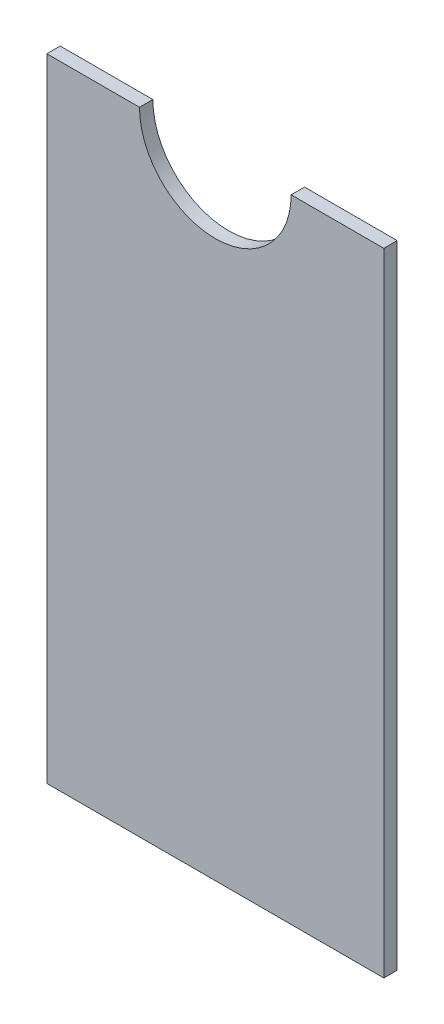
ISO-10303-21;
HEADER;
FILE_DESCRIPTION(('STEP AP214'),'2;1');
FILE_NAME('part.step','',(''),(''),'','','');
FILE_SCHEMA(('AUTOMOTIVE_DESIGN { 1 0 10303 214 1 1 1 1 }'));
ENDSEC;
DATA;
#1=APPLICATION_CONTEXT('core data for automotive mechanical design processes');
#2=APPLICATION_PROTOCOL_DEFINITION('international standard','automotive_design',2000,#1);
#3=PRODUCT_CONTEXT('',#1,'mechanical');
#4=PRODUCT('Part','Part','',(#3));
#5=PRODUCT_RELATED_PRODUCT_CATEGORY('part','',(#4));
#6=PRODUCT_DEFINITION_FORMATION('','',#4);
#7=PRODUCT_DEFINITION_CONTEXT('part definition',#1,'design');
#8=PRODUCT_DEFINITION('design','',#6,#7);
#9=PRODUCT_DEFINITION_SHAPE('','',#8);
#10=(LENGTH_UNIT() NAMED_UNIT(*) SI_UNIT(.MILLI.,.METRE.));
#11=(NAMED_UNIT(*) PLANE_ANGLE_UNIT() SI_UNIT($,.RADIAN.));
#12=(NAMED_UNIT(*) SI_UNIT($,.STERADIAN.) SOLID_ANGLE_UNIT());
#13=UNCERTAINTY_MEASURE_WITH_UNIT(LENGTH_MEASURE(1.E-05),#10,'distance_accuracy_value','');
#14=(GEOMETRIC_REPRESENTATION_CONTEXT(3) GLOBAL_UNCERTAINTY_ASSIGNED_CONTEXT((#13)) GLOBAL_UNIT_ASSIGNED_CONTEXT((#10,
#11,#12)) REPRESENTATION_CONTEXT('',''));
#15=CARTESIAN_POINT('',(0.,0.,0.));
#16=DIRECTION('',(0.,0.,1.));
#17=DIRECTION('',(1.,0.,0.));
#18=AXIS2_PLACEMENT_3D('',#15,#16,#17);
#19=CARTESIAN_POINT('',(-40.,75.,3.175));
#20=DIRECTION('',(0.,1.,0.));
#21=DIRECTION('',(0.,0.,1.));
#22=AXIS2_PLACEMENT_3D('',#19,#20,#21);
#23=PLANE('',#22);
#24=DIRECTION('',(1.,0.,0.));
#25=VECTOR('',#24,1.);
#26=CARTESIAN_POINT('',(-40.,75.,0.));
#27=LINE('',#26,#25);
#28=CARTESIAN_POINT('',(-40.,75.,0.));
#29=VERTEX_POINT('',#28);
#30=CARTESIAN_POINT('',(-18.,75.,0.));
#31=VERTEX_POINT('',#30);
#32=EDGE_CURVE('E124',#29,#31,#27,.T.);
#33=ORIENTED_EDGE('',*,*,#32,.F.);
#34=DIRECTION('',(0.,0.,-1.));
#35=VECTOR('',#34,1.);
#36=CARTESIAN_POINT('',(-40.,75.,3.175));
#37=LINE('',#36,#35);
#38=CARTESIAN_POINT('',(-40.,75.,3.175));
#39=VERTEX_POINT('',#38);
#40=EDGE_CURVE('E11',#39,#29,#37,.T.);
#41=ORIENTED_EDGE('',*,*,#40,.F.);
#42=DIRECTION('',(1.,0.,0.));
#43=VECTOR('',#42,1.);
#44=CARTESIAN_POINT('',(-40.,75.,3.175));
#45=LINE('',#44,#43);
#46=CARTESIAN_POINT('',(-18.,75.,3.175));
#47=VERTEX_POINT('',#46);
#48=EDGE_CURVE('E136',#39,#47,#45,.T.);
#49=ORIENTED_EDGE('',*,*,#48,.T.);
#50=DIRECTION('',(0.,0.,-1.));
#51=VECTOR('',#50,1.);
#52=CARTESIAN_POINT('',(-18.,75.,3.175));
#53=LINE('',#52,#51);
#54=EDGE_CURVE('E40',#47,#31,#53,.T.);
#55=ORIENTED_EDGE('',*,*,#54,.T.);
#56=EDGE_LOOP('',(#33,#41,#49,#55));
#57=FACE_BOUND('',#56,.T.);
#58=ADVANCED_FACE('F37',(#57),#23,.T.);
#59=CARTESIAN_POINT('',(-40.,75.,3.175));
#60=DIRECTION('',(1.,0.,0.));
#61=DIRECTION('',(0.,1.,0.));
#62=AXIS2_PLACEMENT_3D('',#59,#60,#61);
#63=PLANE('',#62);
#64=DIRECTION('',(0.,-1.,0.));
#65=VECTOR('',#64,1.);
#66=CARTESIAN_POINT('',(-40.,75.,0.));
#67=LINE('',#66,#65);
#68=CARTESIAN_POINT('',(-40.,-75.,0.));
#69=VERTEX_POINT('',#68);
#70=EDGE_CURVE('E76',#29,#69,#67,.T.);
#71=ORIENTED_EDGE('',*,*,#70,.T.);
#72=DIRECTION('',(0.,0.,-1.));
#73=VECTOR('',#72,1.);
#74=CARTESIAN_POINT('',(-40.,-75.,3.175));
#75=LINE('',#74,#73);
#76=CARTESIAN_POINT('',(-40.,-75.,3.175));
#77=VERTEX_POINT('',#76);
#78=EDGE_CURVE('E46',#77,#69,#75,.T.);
#79=ORIENTED_EDGE('',*,*,#78,.F.);
#80=DIRECTION('',(0.,-1.,0.));
#81=VECTOR('',#80,1.);
#82=CARTESIAN_POINT('',(-40.,75.,3.175));
#83=LINE('',#82,#81);
#84=EDGE_CURVE('E103',#39,#77,#83,.T.);
#85=ORIENTED_EDGE('',*,*,#84,.F.);
#86=ORIENTED_EDGE('',*,*,#40,.T.);
#87=EDGE_LOOP('',(#71,#79,#85,#86));
#88=FACE_BOUND('',#87,.T.);
#89=ADVANCED_FACE('F155',(#88),#63,.F.);
#90=CARTESIAN_POINT('',(-40.,-75.,3.175));
#91=DIRECTION('',(0.,1.,0.));
#92=DIRECTION('',(0.,0.,1.));
#93=AXIS2_PLACEMENT_3D('',#90,#91,#92);
#94=PLANE('',#93);
#95=DIRECTION('',(1.,0.,0.));
#96=VECTOR('',#95,1.);
#97=CARTESIAN_POINT('',(-40.,-75.,0.));
#98=LINE('',#97,#96);
#99=CARTESIAN_POINT('',(40.,-75.,0.));
#100=VERTEX_POINT('',#99);
#101=EDGE_CURVE('E110',#69,#100,#98,.T.);
#102=ORIENTED_EDGE('',*,*,#101,.T.);
#103=DIRECTION('',(0.,0.,-1.));
#104=VECTOR('',#103,1.);
#105=CARTESIAN_POINT('',(40.,-75.,3.175));
#106=LINE('',#105,#104);
#107=CARTESIAN_POINT('',(40.,-75.,3.175));
#108=VERTEX_POINT('',#107);
#109=EDGE_CURVE('E107',#108,#100,#106,.T.);
#110=ORIENTED_EDGE('',*,*,#109,.F.);
#111=DIRECTION('',(1.,0.,0.));
#112=VECTOR('',#111,1.);
#113=CARTESIAN_POINT('',(-40.,-75.,3.175));
#114=LINE('',#113,#112);
#115=EDGE_CURVE('E95',#77,#108,#114,.T.);
#116=ORIENTED_EDGE('',*,*,#115,.F.);
#117=ORIENTED_EDGE('',*,*,#78,.T.);
#118=EDGE_LOOP('',(#102,#110,#116,#117));
#119=FACE_BOUND('',#118,.T.);
#120=ADVANCED_FACE('F108',(#119),#94,.F.);
#121=CARTESIAN_POINT('',(40.,75.,3.175));
#122=DIRECTION('',(1.,0.,0.));
#123=DIRECTION('',(0.,1.,0.));
#124=AXIS2_PLACEMENT_3D('',#121,#122,#123);
#125=PLANE('',#124);
#126=DIRECTION('',(0.,-1.,0.));
#127=VECTOR('',#126,1.);
#128=CARTESIAN_POINT('',(40.,75.,0.));
#129=LINE('',#128,#127);
#130=CARTESIAN_POINT('',(40.,75.,0.));
#131=VERTEX_POINT('',#130);
#132=EDGE_CURVE('E133',#131,#100,#129,.T.);
#133=ORIENTED_EDGE('',*,*,#132,.F.);
#134=DIRECTION('',(0.,0.,-1.));
#135=VECTOR('',#134,1.);
#136=CARTESIAN_POINT('',(40.,75.,3.175));
#137=LINE('',#136,#135);
#138=CARTESIAN_POINT('',(40.,75.,3.175));
#139=VERTEX_POINT('',#138);
#140=EDGE_CURVE('E114',#139,#131,#137,.T.);
#141=ORIENTED_EDGE('',*,*,#140,.F.);
#142=DIRECTION('',(0.,-1.,0.));
#143=VECTOR('',#142,1.);
#144=CARTESIAN_POINT('',(40.,75.,3.175));
#145=LINE('',#144,#143);
#146=EDGE_CURVE('E101',#139,#108,#145,.T.);
#147=ORIENTED_EDGE('',*,*,#146,.T.);
#148=ORIENTED_EDGE('',*,*,#109,.T.);
#149=EDGE_LOOP('',(#133,#141,#147,#148));
#150=FACE_BOUND('',#149,.T.);
#151=ADVANCED_FACE('F116',(#150),#125,.T.);
#152=CARTESIAN_POINT('',(18.,75.,3.175));
#153=DIRECTION('',(0.,1.,0.));
#154=DIRECTION('',(0.,0.,1.));
#155=AXIS2_PLACEMENT_3D('',#152,#153,#154);
#156=PLANE('',#155);
#157=DIRECTION('',(1.,0.,0.));
#158=VECTOR('',#157,1.);
#159=CARTESIAN_POINT('',(18.,75.,0.));
#160=LINE('',#159,#158);
#161=CARTESIAN_POINT('',(18.,75.,0.));
#162=VERTEX_POINT('',#161);
#163=EDGE_CURVE('E130',#162,#131,#160,.T.);
#164=ORIENTED_EDGE('',*,*,#163,.F.);
#165=DIRECTION('',(0.,0.,-1.));
#166=VECTOR('',#165,1.);
#167=CARTESIAN_POINT('',(18.,75.,3.175));
#168=LINE('',#167,#166);
#169=CARTESIAN_POINT('',(18.,75.,3.175));
#170=VERTEX_POINT('',#169);
#171=EDGE_CURVE('E139',#170,#162,#168,.T.);
#172=ORIENTED_EDGE('',*,*,#171,.F.);
#173=DIRECTION('',(1.,0.,0.));
#174=VECTOR('',#173,1.);
#175=CARTESIAN_POINT('',(18.,75.,3.175));
#176=LINE('',#175,#174);
#177=EDGE_CURVE('E117',#170,#139,#176,.T.);
#178=ORIENTED_EDGE('',*,*,#177,.T.);
#179=ORIENTED_EDGE('',*,*,#140,.T.);
#180=EDGE_LOOP('',(#164,#172,#178,#179));
#181=FACE_BOUND('',#180,.T.);
#182=ADVANCED_FACE('F145',(#181),#156,.T.);
#183=CARTESIAN_POINT('',(0.,75.,3.175));
#184=DIRECTION('',(0.,0.,-1.));
#185=DIRECTION('',(-1.,0.,0.));
#186=AXIS2_PLACEMENT_3D('',#183,#184,#185);
#187=CYLINDRICAL_SURFACE('',#186,18.);
#188=CARTESIAN_POINT('',(0.,75.,0.));
#189=DIRECTION('',(0.,0.,1.));
#190=DIRECTION('',(1.,0.,0.));
#191=AXIS2_PLACEMENT_3D('',#188,#189,#190);
#192=CIRCLE('',#191,18.);
#193=EDGE_CURVE('E127',#31,#162,#192,.T.);
#194=ORIENTED_EDGE('',*,*,#193,.F.);
#195=ORIENTED_EDGE('',*,*,#54,.F.);
#196=CARTESIAN_POINT('',(0.,75.,3.175));
#197=DIRECTION('',(0.,0.,1.));
#198=DIRECTION('',(1.,0.,0.));
#199=AXIS2_PLACEMENT_3D('',#196,#197,#198);
#200=CIRCLE('',#199,18.);
#201=EDGE_CURVE('E119',#47,#170,#200,.T.);
#202=ORIENTED_EDGE('',*,*,#201,.T.);
#203=ORIENTED_EDGE('',*,*,#171,.T.);
#204=EDGE_LOOP('',(#194,#195,#202,#203));
#205=FACE_BOUND('',#204,.T.);
#206=ADVANCED_FACE('F141',(#205),#187,.F.);
#207=CARTESIAN_POINT('',(0.,75.,3.175));
#208=DIRECTION('',(0.,0.,1.));
#209=DIRECTION('',(1.,0.,0.));
#210=AXIS2_PLACEMENT_3D('',#207,#208,#209);
#211=PLANE('',#210);
#212=ORIENTED_EDGE('',*,*,#48,.F.);
#213=ORIENTED_EDGE('',*,*,#84,.T.);
#214=ORIENTED_EDGE('',*,*,#115,.T.);
#215=ORIENTED_EDGE('',*,*,#146,.F.);
#216=ORIENTED_EDGE('',*,*,#177,.F.);
#217=ORIENTED_EDGE('',*,*,#201,.F.);
#218=EDGE_LOOP('',(#212,#213,#214,#215,#216,#217));
#219=FACE_BOUND('',#218,.T.);
#220=ADVANCED_FACE('F98',(#219),#211,.T.);
#221=CARTESIAN_POINT('',(0.,75.,0.));
#222=DIRECTION('',(0.,0.,1.));
#223=DIRECTION('',(1.,0.,0.));
#224=AXIS2_PLACEMENT_3D('',#221,#222,#223);
#225=PLANE('',#224);
#226=ORIENTED_EDGE('',*,*,#32,.T.);
#227=ORIENTED_EDGE('',*,*,#193,.T.);
#228=ORIENTED_EDGE('',*,*,#163,.T.);
#229=ORIENTED_EDGE('',*,*,#132,.T.);
#230=ORIENTED_EDGE('',*,*,#101,.F.);
#231=ORIENTED_EDGE('',*,*,#70,.F.);
#232=EDGE_LOOP('',(#226,#227,#228,#229,#230,#231));
#233=FACE_BOUND('',#232,.T.);
#234=ADVANCED_FACE('F143',(#233),#225,.F.);
#235=CLOSED_SHELL('',(#58,#89,#120,#151,#182,#206,#220,#234));
#236=MANIFOLD_SOLID_BREP('B2',#235);
#237=ADVANCED_BREP_SHAPE_REPRESENTATION('',(#18,#236),#14);
#238=SHAPE_DEFINITION_REPRESENTATION(#9,#237);
ENDSEC;
END-ISO-10303-21;
